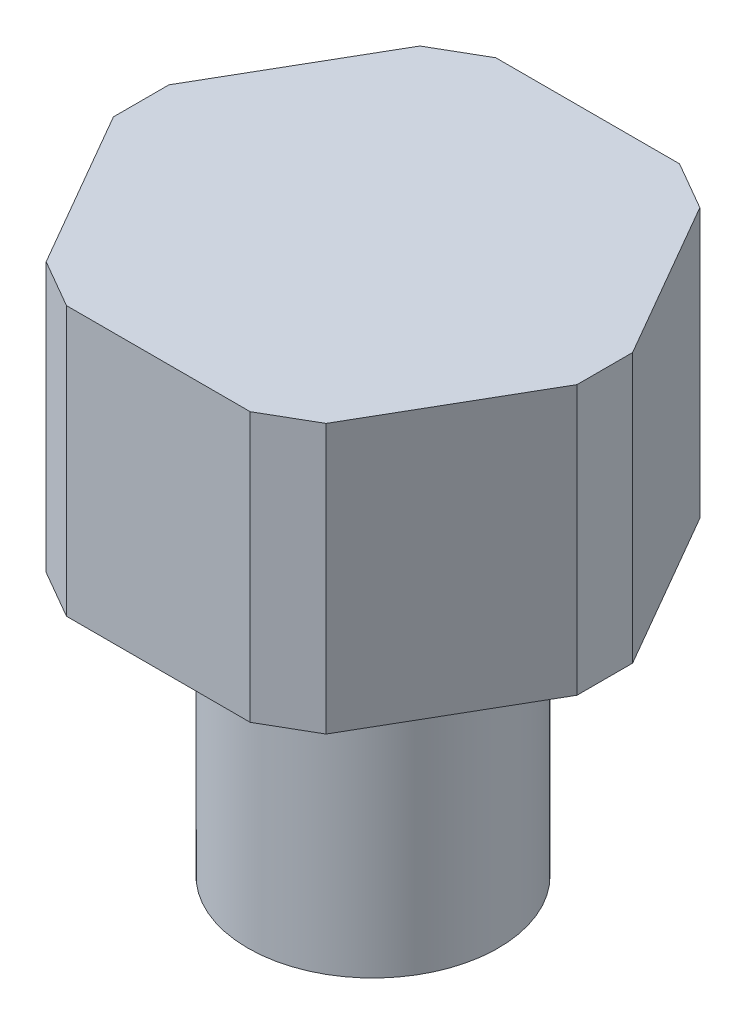
ISO-10303-21;
HEADER;
FILE_DESCRIPTION(('STEP AP214'),'2;1');
FILE_NAME('part.step','',(''),(''),'','','');
FILE_SCHEMA(('AUTOMOTIVE_DESIGN { 1 0 10303 214 1 1 1 1 }'));
ENDSEC;
DATA;
#1=APPLICATION_CONTEXT('core data for automotive mechanical design processes');
#2=APPLICATION_PROTOCOL_DEFINITION('international standard','automotive_design',2000,#1);
#3=PRODUCT_CONTEXT('',#1,'mechanical');
#4=PRODUCT('Part','Part','',(#3));
#5=PRODUCT_RELATED_PRODUCT_CATEGORY('part','',(#4));
#6=PRODUCT_DEFINITION_FORMATION('','',#4);
#7=PRODUCT_DEFINITION_CONTEXT('part definition',#1,'design');
#8=PRODUCT_DEFINITION('design','',#6,#7);
#9=PRODUCT_DEFINITION_SHAPE('','',#8);
#10=(LENGTH_UNIT() NAMED_UNIT(*) SI_UNIT(.MILLI.,.METRE.));
#11=(NAMED_UNIT(*) PLANE_ANGLE_UNIT() SI_UNIT($,.RADIAN.));
#12=(NAMED_UNIT(*) SI_UNIT($,.STERADIAN.) SOLID_ANGLE_UNIT());
#13=UNCERTAINTY_MEASURE_WITH_UNIT(LENGTH_MEASURE(1.E-05),#10,'distance_accuracy_value','');
#14=(GEOMETRIC_REPRESENTATION_CONTEXT(3) GLOBAL_UNCERTAINTY_ASSIGNED_CONTEXT((#13)) GLOBAL_UNIT_ASSIGNED_CONTEXT((#10,
#11,#12)) REPRESENTATION_CONTEXT('',''));
#15=CARTESIAN_POINT('',(0.,0.,0.));
#16=DIRECTION('',(0.,0.,1.));
#17=DIRECTION('',(1.,0.,0.));
#18=AXIS2_PLACEMENT_3D('',#15,#16,#17);
#19=CARTESIAN_POINT('',(0.,12.7,0.));
#20=DIRECTION('',(0.,-1.,0.));
#21=DIRECTION('',(0.,0.,-1.));
#22=AXIS2_PLACEMENT_3D('',#19,#20,#21);
#23=CYLINDRICAL_SURFACE('',#22,5.55625);
#24=CARTESIAN_POINT('',(0.,12.7,0.));
#25=DIRECTION('',(0.,1.,0.));
#26=DIRECTION('',(0.,0.,1.));
#27=AXIS2_PLACEMENT_3D('',#24,#25,#26);
#28=CIRCLE('',#27,5.55625);
#29=CARTESIAN_POINT('',(0.,12.7,5.55625));
#30=VERTEX_POINT('',#29);
#31=EDGE_CURVE('E11',#30,#30,#28,.T.);
#32=ORIENTED_EDGE('',*,*,#31,.F.);
#33=EDGE_LOOP('',(#32));
#34=FACE_BOUND('',#33,.T.);
#35=CARTESIAN_POINT('',(0.,0.,0.));
#36=DIRECTION('',(0.,1.,0.));
#37=DIRECTION('',(0.,0.,1.));
#38=AXIS2_PLACEMENT_3D('',#35,#36,#37);
#39=CIRCLE('',#38,5.55625);
#40=CARTESIAN_POINT('',(0.,0.,5.55625));
#41=VERTEX_POINT('',#40);
#42=EDGE_CURVE('E39',#41,#41,#39,.T.);
#43=ORIENTED_EDGE('',*,*,#42,.T.);
#44=EDGE_LOOP('',(#43));
#45=FACE_BOUND('',#44,.T.);
#46=ADVANCED_FACE('F36',(#34,#45),#23,.T.);
#47=CARTESIAN_POINT('',(0.,0.,0.));
#48=DIRECTION('',(0.,1.,0.));
#49=DIRECTION('',(0.,0.,1.));
#50=AXIS2_PLACEMENT_3D('',#47,#48,#49);
#51=PLANE('',#50);
#52=ORIENTED_EDGE('',*,*,#42,.F.);
#53=EDGE_LOOP('',(#52));
#54=FACE_BOUND('',#53,.T.);
#55=ADVANCED_FACE('F210',(#54),#51,.F.);
#56=CARTESIAN_POINT('',(0.,12.7,0.));
#57=DIRECTION('',(0.,-1.,0.));
#58=DIRECTION('',(0.,0.,-1.));
#59=AXIS2_PLACEMENT_3D('',#56,#57,#58);
#60=PLANE('',#59);
#61=DIRECTION('',(-0.5,0.,0.866025403784439));
#62=VECTOR('',#61,1.);
#63=CARTESIAN_POINT('',(-10.287,12.7,-1.23239334253896));
#64=LINE('',#63,#62);
#65=CARTESIAN_POINT('',(-6.21078389403118,12.7,-8.29260674070751));
#66=VERTEX_POINT('',#65);
#67=CARTESIAN_POINT('',(-10.287,12.7,-1.23239334253896));
#68=VERTEX_POINT('',#67);
#69=EDGE_CURVE('E157',#66,#68,#64,.T.);
#70=ORIENTED_EDGE('',*,*,#69,.F.);
#71=DIRECTION('',(-0.866025403784439,0.,0.5));
#72=VECTOR('',#71,1.);
#73=CARTESIAN_POINT('',(-6.21078389403118,12.7,-8.29260674070751));
#74=LINE('',#73,#72);
#75=CARTESIAN_POINT('',(-4.07621615403118,12.7,-9.525));
#76=VERTEX_POINT('',#75);
#77=EDGE_CURVE('E99',#76,#66,#74,.T.);
#78=ORIENTED_EDGE('',*,*,#77,.F.);
#79=DIRECTION('',(-1.,0.,0.));
#80=VECTOR('',#79,1.);
#81=CARTESIAN_POINT('',(-4.07621615403118,12.7,-9.525));
#82=LINE('',#81,#80);
#83=CARTESIAN_POINT('',(4.07621615403119,12.7,-9.525));
#84=VERTEX_POINT('',#83);
#85=EDGE_CURVE('E93',#84,#76,#82,.T.);
#86=ORIENTED_EDGE('',*,*,#85,.F.);
#87=DIRECTION('',(-0.866025403784439,0.,-0.5));
#88=VECTOR('',#87,1.);
#89=CARTESIAN_POINT('',(4.07621615403119,12.7,-9.525));
#90=LINE('',#89,#88);
#91=CARTESIAN_POINT('',(6.21078389403119,12.7,-8.29260674070751));
#92=VERTEX_POINT('',#91);
#93=EDGE_CURVE('E147',#92,#84,#90,.T.);
#94=ORIENTED_EDGE('',*,*,#93,.F.);
#95=DIRECTION('',(-0.5,0.,-0.866025403784439));
#96=VECTOR('',#95,1.);
#97=CARTESIAN_POINT('',(6.21078389403119,12.7,-8.29260674070751));
#98=LINE('',#97,#96);
#99=CARTESIAN_POINT('',(10.287,12.7,-1.23239334253896));
#100=VERTEX_POINT('',#99);
#101=EDGE_CURVE('E174',#100,#92,#98,.T.);
#102=ORIENTED_EDGE('',*,*,#101,.F.);
#103=DIRECTION('',(0.,0.,-1.));
#104=VECTOR('',#103,1.);
#105=CARTESIAN_POINT('',(10.287,12.7,-1.23239334253896));
#106=LINE('',#105,#104);
#107=CARTESIAN_POINT('',(10.287,12.7,1.23239334253896));
#108=VERTEX_POINT('',#107);
#109=EDGE_CURVE('E172',#108,#100,#106,.T.);
#110=ORIENTED_EDGE('',*,*,#109,.F.);
#111=DIRECTION('',(0.5,0.,-0.866025403784439));
#112=VECTOR('',#111,1.);
#113=CARTESIAN_POINT('',(10.287,12.7,1.23239334253896));
#114=LINE('',#113,#112);
#115=CARTESIAN_POINT('',(6.21078389403119,12.7,8.29260674070751));
#116=VERTEX_POINT('',#115);
#117=EDGE_CURVE('E170',#116,#108,#114,.T.);
#118=ORIENTED_EDGE('',*,*,#117,.F.);
#119=DIRECTION('',(0.866025403784439,0.,-0.5));
#120=VECTOR('',#119,1.);
#121=CARTESIAN_POINT('',(4.07621615403119,12.7,9.525));
#122=LINE('',#121,#120);
#123=CARTESIAN_POINT('',(4.07621615403119,12.7,9.525));
#124=VERTEX_POINT('',#123);
#125=EDGE_CURVE('E168',#124,#116,#122,.T.);
#126=ORIENTED_EDGE('',*,*,#125,.F.);
#127=DIRECTION('',(1.,0.,0.));
#128=VECTOR('',#127,1.);
#129=CARTESIAN_POINT('',(-4.07621615403119,12.7,9.525));
#130=LINE('',#129,#128);
#131=CARTESIAN_POINT('',(-4.07621615403119,12.7,9.525));
#132=VERTEX_POINT('',#131);
#133=EDGE_CURVE('E166',#132,#124,#130,.T.);
#134=ORIENTED_EDGE('',*,*,#133,.F.);
#135=DIRECTION('',(0.866025403784439,0.,0.5));
#136=VECTOR('',#135,1.);
#137=CARTESIAN_POINT('',(-6.21078389403119,12.7,8.29260674070751));
#138=LINE('',#137,#136);
#139=CARTESIAN_POINT('',(-6.21078389403119,12.7,8.29260674070751));
#140=VERTEX_POINT('',#139);
#141=EDGE_CURVE('E164',#140,#132,#138,.T.);
#142=ORIENTED_EDGE('',*,*,#141,.F.);
#143=DIRECTION('',(0.5,0.,0.866025403784439));
#144=VECTOR('',#143,1.);
#145=CARTESIAN_POINT('',(-10.287,12.7,1.23239334253896));
#146=LINE('',#145,#144);
#147=CARTESIAN_POINT('',(-10.287,12.7,1.23239334253896));
#148=VERTEX_POINT('',#147);
#149=EDGE_CURVE('E162',#148,#140,#146,.T.);
#150=ORIENTED_EDGE('',*,*,#149,.F.);
#151=DIRECTION('',(0.,0.,1.));
#152=VECTOR('',#151,1.);
#153=CARTESIAN_POINT('',(-10.287,12.7,-1.23239334253896));
#154=LINE('',#153,#152);
#155=EDGE_CURVE('E160',#68,#148,#154,.T.);
#156=ORIENTED_EDGE('',*,*,#155,.F.);
#157=EDGE_LOOP('',(#70,#78,#86,#94,#102,#110,#118,#126,#134,#142,#150,#156));
#158=FACE_BOUND('',#157,.T.);
#159=ORIENTED_EDGE('',*,*,#31,.T.);
#160=EDGE_LOOP('',(#159));
#161=FACE_BOUND('',#160,.T.);
#162=ADVANCED_FACE('F212',(#158,#161),#60,.T.);
#163=CARTESIAN_POINT('',(-10.287,24.638,-1.23239334253896));
#164=DIRECTION('',(0.866025403784439,0.,0.5));
#165=DIRECTION('',(0.5,0.,-0.866025403784439));
#166=AXIS2_PLACEMENT_3D('',#163,#164,#165);
#167=PLANE('',#166);
#168=ORIENTED_EDGE('',*,*,#69,.T.);
#169=DIRECTION('',(0.,-1.,0.));
#170=VECTOR('',#169,1.);
#171=CARTESIAN_POINT('',(-10.287,24.638,-1.23239334253896));
#172=LINE('',#171,#170);
#173=CARTESIAN_POINT('',(-10.287,24.638,-1.23239334253896));
#174=VERTEX_POINT('',#173);
#175=EDGE_CURVE('E204',#174,#68,#172,.T.);
#176=ORIENTED_EDGE('',*,*,#175,.F.);
#177=DIRECTION('',(-0.5,0.,0.866025403784439));
#178=VECTOR('',#177,1.);
#179=CARTESIAN_POINT('',(-10.287,24.638,-1.23239334253896));
#180=LINE('',#179,#178);
#181=CARTESIAN_POINT('',(-6.21078389403118,24.638,-8.29260674070751));
#182=VERTEX_POINT('',#181);
#183=EDGE_CURVE('E179',#182,#174,#180,.T.);
#184=ORIENTED_EDGE('',*,*,#183,.F.);
#185=DIRECTION('',(0.,-1.,0.));
#186=VECTOR('',#185,1.);
#187=CARTESIAN_POINT('',(-6.21078389403118,24.638,-8.29260674070751));
#188=LINE('',#187,#186);
#189=EDGE_CURVE('E153',#182,#66,#188,.T.);
#190=ORIENTED_EDGE('',*,*,#189,.T.);
#191=EDGE_LOOP('',(#168,#176,#184,#190));
#192=FACE_BOUND('',#191,.T.);
#193=ADVANCED_FACE('F217',(#192),#167,.F.);
#194=CARTESIAN_POINT('',(-10.287,24.638,-1.23239334253896));
#195=DIRECTION('',(1.,0.,0.));
#196=DIRECTION('',(0.,0.,-1.));
#197=AXIS2_PLACEMENT_3D('',#194,#195,#196);
#198=PLANE('',#197);
#199=ORIENTED_EDGE('',*,*,#155,.T.);
#200=DIRECTION('',(0.,-1.,0.));
#201=VECTOR('',#200,1.);
#202=CARTESIAN_POINT('',(-10.287,24.638,1.23239334253896));
#203=LINE('',#202,#201);
#204=CARTESIAN_POINT('',(-10.287,24.638,1.23239334253896));
#205=VERTEX_POINT('',#204);
#206=EDGE_CURVE('E201',#205,#148,#203,.T.);
#207=ORIENTED_EDGE('',*,*,#206,.F.);
#208=DIRECTION('',(0.,0.,1.));
#209=VECTOR('',#208,1.);
#210=CARTESIAN_POINT('',(-10.287,24.638,-1.23239334253896));
#211=LINE('',#210,#209);
#212=EDGE_CURVE('E108',#174,#205,#211,.T.);
#213=ORIENTED_EDGE('',*,*,#212,.F.);
#214=ORIENTED_EDGE('',*,*,#175,.T.);
#215=EDGE_LOOP('',(#199,#207,#213,#214));
#216=FACE_BOUND('',#215,.T.);
#217=ADVANCED_FACE('F224',(#216),#198,.F.);
#218=CARTESIAN_POINT('',(-10.287,24.638,1.23239334253896));
#219=DIRECTION('',(0.866025403784439,0.,-0.5));
#220=DIRECTION('',(-0.5,0.,-0.866025403784439));
#221=AXIS2_PLACEMENT_3D('',#218,#219,#220);
#222=PLANE('',#221);
#223=ORIENTED_EDGE('',*,*,#149,.T.);
#224=DIRECTION('',(0.,-1.,0.));
#225=VECTOR('',#224,1.);
#226=CARTESIAN_POINT('',(-6.21078389403119,24.638,8.29260674070751));
#227=LINE('',#226,#225);
#228=CARTESIAN_POINT('',(-6.21078389403119,24.638,8.29260674070751));
#229=VERTEX_POINT('',#228);
#230=EDGE_CURVE('E198',#229,#140,#227,.T.);
#231=ORIENTED_EDGE('',*,*,#230,.F.);
#232=DIRECTION('',(0.5,0.,0.866025403784439));
#233=VECTOR('',#232,1.);
#234=CARTESIAN_POINT('',(-10.287,24.638,1.23239334253896));
#235=LINE('',#234,#233);
#236=EDGE_CURVE('E366',#205,#229,#235,.T.);
#237=ORIENTED_EDGE('',*,*,#236,.F.);
#238=ORIENTED_EDGE('',*,*,#206,.T.);
#239=EDGE_LOOP('',(#223,#231,#237,#238));
#240=FACE_BOUND('',#239,.T.);
#241=ADVANCED_FACE('F228',(#240),#222,.F.);
#242=CARTESIAN_POINT('',(-6.21078389403119,24.638,8.29260674070751));
#243=DIRECTION('',(0.5,0.,-0.866025403784439));
#244=DIRECTION('',(-0.866025403784439,0.,-0.5));
#245=AXIS2_PLACEMENT_3D('',#242,#243,#244);
#246=PLANE('',#245);
#247=ORIENTED_EDGE('',*,*,#141,.T.);
#248=DIRECTION('',(0.,-1.,0.));
#249=VECTOR('',#248,1.);
#250=CARTESIAN_POINT('',(-4.07621615403119,24.638,9.525));
#251=LINE('',#250,#249);
#252=CARTESIAN_POINT('',(-4.07621615403119,24.638,9.525));
#253=VERTEX_POINT('',#252);
#254=EDGE_CURVE('E195',#253,#132,#251,.T.);
#255=ORIENTED_EDGE('',*,*,#254,.F.);
#256=DIRECTION('',(0.866025403784439,0.,0.5));
#257=VECTOR('',#256,1.);
#258=CARTESIAN_POINT('',(-6.21078389403119,24.638,8.29260674070751));
#259=LINE('',#258,#257);
#260=EDGE_CURVE('E370',#229,#253,#259,.T.);
#261=ORIENTED_EDGE('',*,*,#260,.F.);
#262=ORIENTED_EDGE('',*,*,#230,.T.);
#263=EDGE_LOOP('',(#247,#255,#261,#262));
#264=FACE_BOUND('',#263,.T.);
#265=ADVANCED_FACE('F231',(#264),#246,.F.);
#266=CARTESIAN_POINT('',(-4.07621615403119,24.638,9.525));
#267=DIRECTION('',(0.,0.,-1.));
#268=DIRECTION('',(-1.,0.,0.));
#269=AXIS2_PLACEMENT_3D('',#266,#267,#268);
#270=PLANE('',#269);
#271=ORIENTED_EDGE('',*,*,#133,.T.);
#272=DIRECTION('',(0.,-1.,0.));
#273=VECTOR('',#272,1.);
#274=CARTESIAN_POINT('',(4.07621615403119,24.638,9.525));
#275=LINE('',#274,#273);
#276=CARTESIAN_POINT('',(4.07621615403119,24.638,9.525));
#277=VERTEX_POINT('',#276);
#278=EDGE_CURVE('E192',#277,#124,#275,.T.);
#279=ORIENTED_EDGE('',*,*,#278,.F.);
#280=DIRECTION('',(1.,0.,0.));
#281=VECTOR('',#280,1.);
#282=CARTESIAN_POINT('',(-4.07621615403119,24.638,9.525));
#283=LINE('',#282,#281);
#284=EDGE_CURVE('E372',#253,#277,#283,.T.);
#285=ORIENTED_EDGE('',*,*,#284,.F.);
#286=ORIENTED_EDGE('',*,*,#254,.T.);
#287=EDGE_LOOP('',(#271,#279,#285,#286));
#288=FACE_BOUND('',#287,.T.);
#289=ADVANCED_FACE('F235',(#288),#270,.F.);
#290=CARTESIAN_POINT('',(4.07621615403119,24.638,9.525));
#291=DIRECTION('',(-0.5,0.,-0.866025403784439));
#292=DIRECTION('',(-0.866025403784439,0.,0.5));
#293=AXIS2_PLACEMENT_3D('',#290,#291,#292);
#294=PLANE('',#293);
#295=ORIENTED_EDGE('',*,*,#125,.T.);
#296=DIRECTION('',(0.,-1.,0.));
#297=VECTOR('',#296,1.);
#298=CARTESIAN_POINT('',(6.21078389403119,24.638,8.29260674070751));
#299=LINE('',#298,#297);
#300=CARTESIAN_POINT('',(6.21078389403119,24.638,8.29260674070751));
#301=VERTEX_POINT('',#300);
#302=EDGE_CURVE('E189',#301,#116,#299,.T.);
#303=ORIENTED_EDGE('',*,*,#302,.F.);
#304=DIRECTION('',(0.866025403784439,0.,-0.5));
#305=VECTOR('',#304,1.);
#306=CARTESIAN_POINT('',(4.07621615403119,24.638,9.525));
#307=LINE('',#306,#305);
#308=EDGE_CURVE('E374',#277,#301,#307,.T.);
#309=ORIENTED_EDGE('',*,*,#308,.F.);
#310=ORIENTED_EDGE('',*,*,#278,.T.);
#311=EDGE_LOOP('',(#295,#303,#309,#310));
#312=FACE_BOUND('',#311,.T.);
#313=ADVANCED_FACE('F239',(#312),#294,.F.);
#314=CARTESIAN_POINT('',(10.287,24.638,1.23239334253896));
#315=DIRECTION('',(-0.866025403784439,0.,-0.5));
#316=DIRECTION('',(-0.5,0.,0.866025403784439));
#317=AXIS2_PLACEMENT_3D('',#314,#315,#316);
#318=PLANE('',#317);
#319=ORIENTED_EDGE('',*,*,#117,.T.);
#320=DIRECTION('',(0.,-1.,0.));
#321=VECTOR('',#320,1.);
#322=CARTESIAN_POINT('',(10.287,24.638,1.23239334253896));
#323=LINE('',#322,#321);
#324=CARTESIAN_POINT('',(10.287,24.638,1.23239334253896));
#325=VERTEX_POINT('',#324);
#326=EDGE_CURVE('E186',#325,#108,#323,.T.);
#327=ORIENTED_EDGE('',*,*,#326,.F.);
#328=DIRECTION('',(0.5,0.,-0.866025403784439));
#329=VECTOR('',#328,1.);
#330=CARTESIAN_POINT('',(10.287,24.638,1.23239334253896));
#331=LINE('',#330,#329);
#332=EDGE_CURVE('E376',#301,#325,#331,.T.);
#333=ORIENTED_EDGE('',*,*,#332,.F.);
#334=ORIENTED_EDGE('',*,*,#302,.T.);
#335=EDGE_LOOP('',(#319,#327,#333,#334));
#336=FACE_BOUND('',#335,.T.);
#337=ADVANCED_FACE('F243',(#336),#318,.F.);
#338=CARTESIAN_POINT('',(10.287,24.638,-1.23239334253896));
#339=DIRECTION('',(-1.,0.,0.));
#340=DIRECTION('',(0.,0.,1.));
#341=AXIS2_PLACEMENT_3D('',#338,#339,#340);
#342=PLANE('',#341);
#343=ORIENTED_EDGE('',*,*,#109,.T.);
#344=DIRECTION('',(0.,-1.,0.));
#345=VECTOR('',#344,1.);
#346=CARTESIAN_POINT('',(10.287,24.638,-1.23239334253896));
#347=LINE('',#346,#345);
#348=CARTESIAN_POINT('',(10.287,24.638,-1.23239334253896));
#349=VERTEX_POINT('',#348);
#350=EDGE_CURVE('E183',#349,#100,#347,.T.);
#351=ORIENTED_EDGE('',*,*,#350,.F.);
#352=DIRECTION('',(0.,0.,-1.));
#353=VECTOR('',#352,1.);
#354=CARTESIAN_POINT('',(10.287,24.638,-1.23239334253896));
#355=LINE('',#354,#353);
#356=EDGE_CURVE('E378',#325,#349,#355,.T.);
#357=ORIENTED_EDGE('',*,*,#356,.F.);
#358=ORIENTED_EDGE('',*,*,#326,.T.);
#359=EDGE_LOOP('',(#343,#351,#357,#358));
#360=FACE_BOUND('',#359,.T.);
#361=ADVANCED_FACE('F247',(#360),#342,.F.);
#362=CARTESIAN_POINT('',(6.21078389403119,24.638,-8.29260674070751));
#363=DIRECTION('',(-0.866025403784439,0.,0.5));
#364=DIRECTION('',(0.5,0.,0.866025403784439));
#365=AXIS2_PLACEMENT_3D('',#362,#363,#364);
#366=PLANE('',#365);
#367=ORIENTED_EDGE('',*,*,#101,.T.);
#368=DIRECTION('',(0.,-1.,0.));
#369=VECTOR('',#368,1.);
#370=CARTESIAN_POINT('',(6.21078389403119,24.638,-8.29260674070751));
#371=LINE('',#370,#369);
#372=CARTESIAN_POINT('',(6.21078389403119,24.638,-8.29260674070751));
#373=VERTEX_POINT('',#372);
#374=EDGE_CURVE('E148',#373,#92,#371,.T.);
#375=ORIENTED_EDGE('',*,*,#374,.F.);
#376=DIRECTION('',(-0.5,0.,-0.866025403784439));
#377=VECTOR('',#376,1.);
#378=CARTESIAN_POINT('',(6.21078389403119,24.638,-8.29260674070751));
#379=LINE('',#378,#377);
#380=EDGE_CURVE('E139',#349,#373,#379,.T.);
#381=ORIENTED_EDGE('',*,*,#380,.F.);
#382=ORIENTED_EDGE('',*,*,#350,.T.);
#383=EDGE_LOOP('',(#367,#375,#381,#382));
#384=FACE_BOUND('',#383,.T.);
#385=ADVANCED_FACE('F251',(#384),#366,.F.);
#386=CARTESIAN_POINT('',(4.07621615403119,24.638,-9.525));
#387=DIRECTION('',(-0.5,0.,0.866025403784439));
#388=DIRECTION('',(0.866025403784439,0.,0.5));
#389=AXIS2_PLACEMENT_3D('',#386,#387,#388);
#390=PLANE('',#389);
#391=ORIENTED_EDGE('',*,*,#93,.T.);
#392=DIRECTION('',(0.,-1.,0.));
#393=VECTOR('',#392,1.);
#394=CARTESIAN_POINT('',(4.07621615403119,24.638,-9.525));
#395=LINE('',#394,#393);
#396=CARTESIAN_POINT('',(4.07621615403119,24.638,-9.525));
#397=VERTEX_POINT('',#396);
#398=EDGE_CURVE('E144',#397,#84,#395,.T.);
#399=ORIENTED_EDGE('',*,*,#398,.F.);
#400=DIRECTION('',(-0.866025403784439,0.,-0.5));
#401=VECTOR('',#400,1.);
#402=CARTESIAN_POINT('',(4.07621615403119,24.638,-9.525));
#403=LINE('',#402,#401);
#404=EDGE_CURVE('E133',#373,#397,#403,.T.);
#405=ORIENTED_EDGE('',*,*,#404,.F.);
#406=ORIENTED_EDGE('',*,*,#374,.T.);
#407=EDGE_LOOP('',(#391,#399,#405,#406));
#408=FACE_BOUND('',#407,.T.);
#409=ADVANCED_FACE('F145',(#408),#390,.F.);
#410=CARTESIAN_POINT('',(-4.07621615403118,24.638,-9.525));
#411=DIRECTION('',(0.,0.,1.));
#412=DIRECTION('',(1.,0.,0.));
#413=AXIS2_PLACEMENT_3D('',#410,#411,#412);
#414=PLANE('',#413);
#415=ORIENTED_EDGE('',*,*,#85,.T.);
#416=DIRECTION('',(0.,-1.,0.));
#417=VECTOR('',#416,1.);
#418=CARTESIAN_POINT('',(-4.07621615403118,24.638,-9.525));
#419=LINE('',#418,#417);
#420=CARTESIAN_POINT('',(-4.07621615403118,24.638,-9.525));
#421=VERTEX_POINT('',#420);
#422=EDGE_CURVE('E149',#421,#76,#419,.T.);
#423=ORIENTED_EDGE('',*,*,#422,.F.);
#424=DIRECTION('',(-1.,0.,0.));
#425=VECTOR('',#424,1.);
#426=CARTESIAN_POINT('',(-4.07621615403118,24.638,-9.525));
#427=LINE('',#426,#425);
#428=EDGE_CURVE('E137',#397,#421,#427,.T.);
#429=ORIENTED_EDGE('',*,*,#428,.F.);
#430=ORIENTED_EDGE('',*,*,#398,.T.);
#431=EDGE_LOOP('',(#415,#423,#429,#430));
#432=FACE_BOUND('',#431,.T.);
#433=ADVANCED_FACE('F151',(#432),#414,.F.);
#434=CARTESIAN_POINT('',(-6.21078389403118,24.638,-8.29260674070751));
#435=DIRECTION('',(0.5,0.,0.866025403784439));
#436=DIRECTION('',(0.866025403784439,0.,-0.5));
#437=AXIS2_PLACEMENT_3D('',#434,#435,#436);
#438=PLANE('',#437);
#439=ORIENTED_EDGE('',*,*,#77,.T.);
#440=ORIENTED_EDGE('',*,*,#189,.F.);
#441=DIRECTION('',(-0.866025403784439,0.,0.5));
#442=VECTOR('',#441,1.);
#443=CARTESIAN_POINT('',(-6.21078389403118,24.638,-8.29260674070751));
#444=LINE('',#443,#442);
#445=EDGE_CURVE('E52',#421,#182,#444,.T.);
#446=ORIENTED_EDGE('',*,*,#445,.F.);
#447=ORIENTED_EDGE('',*,*,#422,.T.);
#448=EDGE_LOOP('',(#439,#440,#446,#447));
#449=FACE_BOUND('',#448,.T.);
#450=ADVANCED_FACE('F260',(#449),#438,.F.);
#451=CARTESIAN_POINT('',(0.,24.638,0.));
#452=DIRECTION('',(0.,-1.,0.));
#453=DIRECTION('',(0.,0.,-1.));
#454=AXIS2_PLACEMENT_3D('',#451,#452,#453);
#455=PLANE('',#454);
#456=ORIENTED_EDGE('',*,*,#183,.T.);
#457=ORIENTED_EDGE('',*,*,#212,.T.);
#458=ORIENTED_EDGE('',*,*,#236,.T.);
#459=ORIENTED_EDGE('',*,*,#260,.T.);
#460=ORIENTED_EDGE('',*,*,#284,.T.);
#461=ORIENTED_EDGE('',*,*,#308,.T.);
#462=ORIENTED_EDGE('',*,*,#332,.T.);
#463=ORIENTED_EDGE('',*,*,#356,.T.);
#464=ORIENTED_EDGE('',*,*,#380,.T.);
#465=ORIENTED_EDGE('',*,*,#404,.T.);
#466=ORIENTED_EDGE('',*,*,#428,.T.);
#467=ORIENTED_EDGE('',*,*,#445,.T.);
#468=EDGE_LOOP('',(#456,#457,#458,#459,#460,#461,#462,#463,#464,#465,#466,#467));
#469=FACE_BOUND('',#468,.T.);
#470=ADVANCED_FACE('F135',(#469),#455,.F.);
#471=CLOSED_SHELL('',(#46,#55,#162,#193,#217,#241,#265,#289,#313,#337,#361,#385,#409,#433,#450,#470));
#472=MANIFOLD_SOLID_BREP('B2',#471);
#473=ADVANCED_BREP_SHAPE_REPRESENTATION('',(#18,#472),#14);
#474=SHAPE_DEFINITION_REPRESENTATION(#9,#473);
ENDSEC;
END-ISO-10303-21;
